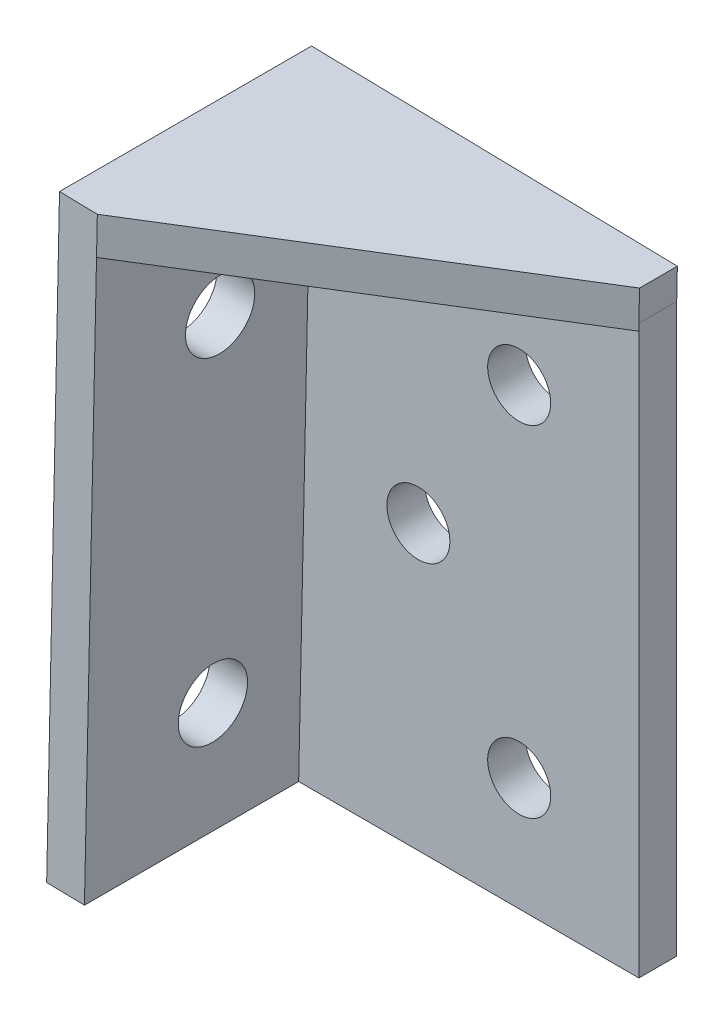
ISO-10303-21;
HEADER;
FILE_DESCRIPTION(('STEP AP214'),'2;1');
FILE_NAME('part.step','',(''),(''),'','','');
FILE_SCHEMA(('AUTOMOTIVE_DESIGN { 1 0 10303 214 1 1 1 1 }'));
ENDSEC;
DATA;
#1=APPLICATION_CONTEXT('core data for automotive mechanical design processes');
#2=APPLICATION_PROTOCOL_DEFINITION('international standard','automotive_design',2000,#1);
#3=PRODUCT_CONTEXT('',#1,'mechanical');
#4=PRODUCT('Part','Part','',(#3));
#5=PRODUCT_RELATED_PRODUCT_CATEGORY('part','',(#4));
#6=PRODUCT_DEFINITION_FORMATION('','',#4);
#7=PRODUCT_DEFINITION_CONTEXT('part definition',#1,'design');
#8=PRODUCT_DEFINITION('design','',#6,#7);
#9=PRODUCT_DEFINITION_SHAPE('','',#8);
#10=(LENGTH_UNIT() NAMED_UNIT(*) SI_UNIT(.MILLI.,.METRE.));
#11=(NAMED_UNIT(*) PLANE_ANGLE_UNIT() SI_UNIT($,.RADIAN.));
#12=(NAMED_UNIT(*) SI_UNIT($,.STERADIAN.) SOLID_ANGLE_UNIT());
#13=UNCERTAINTY_MEASURE_WITH_UNIT(LENGTH_MEASURE(1.E-05),#10,'distance_accuracy_value','');
#14=(GEOMETRIC_REPRESENTATION_CONTEXT(3) GLOBAL_UNCERTAINTY_ASSIGNED_CONTEXT((#13)) GLOBAL_UNIT_ASSIGNED_CONTEXT((#10,
#11,#12)) REPRESENTATION_CONTEXT('',''));
#15=CARTESIAN_POINT('',(0.,0.,0.));
#16=DIRECTION('',(0.,0.,1.));
#17=DIRECTION('',(1.,0.,0.));
#18=AXIS2_PLACEMENT_3D('',#15,#16,#17);
#19=CARTESIAN_POINT('',(0.,0.,3.));
#20=DIRECTION('',(0.,0.,1.));
#21=DIRECTION('',(1.,0.,0.));
#22=AXIS2_PLACEMENT_3D('',#19,#20,#21);
#23=PLANE('',#22);
#24=CARTESIAN_POINT('',(17.5,9.,3.));
#25=DIRECTION('',(0.,0.,1.));
#26=DIRECTION('',(1.,0.,0.));
#27=AXIS2_PLACEMENT_3D('',#24,#25,#26);
#28=CIRCLE('',#27,2.5);
#29=CARTESIAN_POINT('',(20.,9.,3.));
#30=VERTEX_POINT('',#29);
#31=EDGE_CURVE('E201',#30,#30,#28,.T.);
#32=ORIENTED_EDGE('',*,*,#31,.F.);
#33=EDGE_LOOP('',(#32));
#34=FACE_BOUND('',#33,.T.);
#35=CARTESIAN_POINT('',(17.5,36.,3.));
#36=DIRECTION('',(0.,0.,1.));
#37=DIRECTION('',(1.,0.,0.));
#38=AXIS2_PLACEMENT_3D('',#35,#36,#37);
#39=CIRCLE('',#38,2.5);
#40=CARTESIAN_POINT('',(20.,36.,3.));
#41=VERTEX_POINT('',#40);
#42=EDGE_CURVE('E209',#41,#41,#39,.T.);
#43=ORIENTED_EDGE('',*,*,#42,.F.);
#44=EDGE_LOOP('',(#43));
#45=FACE_BOUND('',#44,.T.);
#46=CARTESIAN_POINT('',(9.49999999999999,22.5,3.));
#47=DIRECTION('',(0.,0.,1.));
#48=DIRECTION('',(1.,0.,0.));
#49=AXIS2_PLACEMENT_3D('',#46,#47,#48);
#50=CIRCLE('',#49,2.5);
#51=CARTESIAN_POINT('',(12.,22.5,3.));
#52=VERTEX_POINT('',#51);
#53=EDGE_CURVE('E193',#52,#52,#50,.T.);
#54=ORIENTED_EDGE('',*,*,#53,.F.);
#55=EDGE_LOOP('',(#54));
#56=FACE_BOUND('',#55,.T.);
#57=DIRECTION('',(0.,1.,0.));
#58=VECTOR('',#57,1.);
#59=CARTESIAN_POINT('',(27.,45.,3.));
#60=LINE('',#59,#58);
#61=CARTESIAN_POINT('',(27.,0.,3.));
#62=VERTEX_POINT('',#61);
#63=CARTESIAN_POINT('',(27.,45.,3.));
#64=VERTEX_POINT('',#63);
#65=EDGE_CURVE('E221',#62,#64,#60,.T.);
#66=ORIENTED_EDGE('',*,*,#65,.T.);
#67=DIRECTION('',(-0.0212914078948775,-0.999773312281266,0.));
#68=VECTOR('',#67,1.);
#69=CARTESIAN_POINT('',(27.0520689086383,47.4449818214572,3.));
#70=LINE('',#69,#68);
#71=CARTESIAN_POINT('',(26.9881946849537,44.4456618846134,3.));
#72=VERTEX_POINT('',#71);
#73=EDGE_CURVE('E149',#64,#72,#70,.T.);
#74=ORIENTED_EDGE('',*,*,#73,.T.);
#75=DIRECTION('',(-0.999773312281266,0.0212914078948773,0.));
#76=VECTOR('',#75,1.);
#77=CARTESIAN_POINT('',(0.958330597046315,45.,3.));
#78=LINE('',#77,#76);
#79=CARTESIAN_POINT('',(0.958330597046324,45.,3.));
#80=VERTEX_POINT('',#79);
#81=EDGE_CURVE('E140',#72,#80,#78,.T.);
#82=ORIENTED_EDGE('',*,*,#81,.T.);
#83=DIRECTION('',(-0.0212914078948775,-0.999773312281266,0.));
#84=VECTOR('',#83,1.);
#85=CARTESIAN_POINT('',(0.,0.,3.));
#86=LINE('',#85,#84);
#87=CARTESIAN_POINT('',(0.,0.,3.));
#88=VERTEX_POINT('',#87);
#89=EDGE_CURVE('E226',#80,#88,#86,.T.);
#90=ORIENTED_EDGE('',*,*,#89,.T.);
#91=DIRECTION('',(1.,0.,0.));
#92=VECTOR('',#91,1.);
#93=CARTESIAN_POINT('',(27.,0.,3.));
#94=LINE('',#93,#92);
#95=EDGE_CURVE('E217',#88,#62,#94,.T.);
#96=ORIENTED_EDGE('',*,*,#95,.T.);
#97=EDGE_LOOP('',(#66,#74,#82,#90,#96));
#98=FACE_BOUND('',#97,.T.);
#99=ADVANCED_FACE('F44',(#34,#45,#56,#98),#23,.T.);
#100=CARTESIAN_POINT('',(0.,0.,0.));
#101=DIRECTION('',(0.,0.,1.));
#102=DIRECTION('',(1.,0.,0.));
#103=AXIS2_PLACEMENT_3D('',#100,#101,#102);
#104=PLANE('',#103);
#105=DIRECTION('',(-0.0212914078948775,-0.999773312281266,0.));
#106=VECTOR('',#105,1.);
#107=CARTESIAN_POINT('',(27.0520689086383,47.4449818214572,0.));
#108=LINE('',#107,#106);
#109=CARTESIAN_POINT('',(27.0520689086383,47.4449818214572,0.));
#110=VERTEX_POINT('',#109);
#111=CARTESIAN_POINT('',(27.,45.,0.));
#112=VERTEX_POINT('',#111);
#113=EDGE_CURVE('E245',#110,#112,#108,.T.);
#114=ORIENTED_EDGE('',*,*,#113,.T.);
#115=DIRECTION('',(0.,1.,0.));
#116=VECTOR('',#115,1.);
#117=CARTESIAN_POINT('',(27.,45.,0.));
#118=LINE('',#117,#116);
#119=CARTESIAN_POINT('',(27.,0.,0.));
#120=VERTEX_POINT('',#119);
#121=EDGE_CURVE('E222',#120,#112,#118,.T.);
#122=ORIENTED_EDGE('',*,*,#121,.F.);
#123=DIRECTION('',(1.,0.,0.));
#124=VECTOR('',#123,1.);
#125=CARTESIAN_POINT('',(27.,0.,0.));
#126=LINE('',#125,#124);
#127=CARTESIAN_POINT('',(0.,0.,0.));
#128=VERTEX_POINT('',#127);
#129=EDGE_CURVE('E213',#128,#120,#126,.T.);
#130=ORIENTED_EDGE('',*,*,#129,.F.);
#131=DIRECTION('',(0.999773312281266,-0.0212914078948775,0.));
#132=VECTOR('',#131,1.);
#133=CARTESIAN_POINT('',(-2.9993199368438,0.0638742236846324,0.));
#134=LINE('',#133,#132);
#135=CARTESIAN_POINT('',(-2.9993199368438,0.0638742236846324,0.));
#136=VERTEX_POINT('',#135);
#137=EDGE_CURVE('E189',#136,#128,#134,.T.);
#138=ORIENTED_EDGE('',*,*,#137,.F.);
#139=DIRECTION('',(-0.0212914078948775,-0.999773312281266,0.));
#140=VECTOR('',#139,1.);
#141=CARTESIAN_POINT('',(-2.9993199368438,0.0638742236846324,0.));
#142=LINE('',#141,#140);
#143=CARTESIAN_POINT('',(-1.97711511611284,48.0631941605284,0.));
#144=VERTEX_POINT('',#143);
#145=EDGE_CURVE('E169',#144,#136,#142,.T.);
#146=ORIENTED_EDGE('',*,*,#145,.F.);
#147=DIRECTION('',(-0.999773312281266,0.0212914078948773,0.));
#148=VECTOR('',#147,1.);
#149=CARTESIAN_POINT('',(27.0520689086383,47.4449818214572,0.));
#150=LINE('',#149,#148);
#151=EDGE_CURVE('E253',#110,#144,#150,.T.);
#152=ORIENTED_EDGE('',*,*,#151,.F.);
#153=EDGE_LOOP('',(#114,#122,#130,#138,#146,#152));
#154=FACE_BOUND('',#153,.T.);
#155=CARTESIAN_POINT('',(9.49999999999999,22.5,0.));
#156=DIRECTION('',(0.,0.,1.));
#157=DIRECTION('',(1.,0.,0.));
#158=AXIS2_PLACEMENT_3D('',#155,#156,#157);
#159=CIRCLE('',#158,2.5);
#160=CARTESIAN_POINT('',(12.,22.5,0.));
#161=VERTEX_POINT('',#160);
#162=EDGE_CURVE('E192',#161,#161,#159,.T.);
#163=ORIENTED_EDGE('',*,*,#162,.T.);
#164=EDGE_LOOP('',(#163));
#165=FACE_BOUND('',#164,.T.);
#166=CARTESIAN_POINT('',(17.5,9.,0.));
#167=DIRECTION('',(0.,0.,1.));
#168=DIRECTION('',(1.,0.,0.));
#169=AXIS2_PLACEMENT_3D('',#166,#167,#168);
#170=CIRCLE('',#169,2.5);
#171=CARTESIAN_POINT('',(20.,9.,0.));
#172=VERTEX_POINT('',#171);
#173=EDGE_CURVE('E197',#172,#172,#170,.T.);
#174=ORIENTED_EDGE('',*,*,#173,.T.);
#175=EDGE_LOOP('',(#174));
#176=FACE_BOUND('',#175,.T.);
#177=CARTESIAN_POINT('',(17.5,36.,0.));
#178=DIRECTION('',(0.,0.,1.));
#179=DIRECTION('',(1.,0.,0.));
#180=AXIS2_PLACEMENT_3D('',#177,#178,#179);
#181=CIRCLE('',#180,2.5);
#182=CARTESIAN_POINT('',(20.,36.,0.));
#183=VERTEX_POINT('',#182);
#184=EDGE_CURVE('E205',#183,#183,#181,.T.);
#185=ORIENTED_EDGE('',*,*,#184,.T.);
#186=EDGE_LOOP('',(#185));
#187=FACE_BOUND('',#186,.T.);
#188=ADVANCED_FACE('F250',(#154,#165,#176,#187),#104,.F.);
#189=CARTESIAN_POINT('',(27.,0.,3.));
#190=DIRECTION('',(0.,1.,0.));
#191=DIRECTION('',(0.,0.,1.));
#192=AXIS2_PLACEMENT_3D('',#189,#190,#191);
#193=PLANE('',#192);
#194=ORIENTED_EDGE('',*,*,#129,.T.);
#195=DIRECTION('',(0.,0.,-1.));
#196=VECTOR('',#195,1.);
#197=CARTESIAN_POINT('',(27.,0.,3.));
#198=LINE('',#197,#196);
#199=EDGE_CURVE('E11',#62,#120,#198,.T.);
#200=ORIENTED_EDGE('',*,*,#199,.F.);
#201=ORIENTED_EDGE('',*,*,#95,.F.);
#202=DIRECTION('',(0.,0.,-1.));
#203=VECTOR('',#202,1.);
#204=CARTESIAN_POINT('',(0.,0.,3.));
#205=LINE('',#204,#203);
#206=EDGE_CURVE('E61',#88,#128,#205,.T.);
#207=ORIENTED_EDGE('',*,*,#206,.T.);
#208=EDGE_LOOP('',(#194,#200,#201,#207));
#209=FACE_BOUND('',#208,.T.);
#210=ADVANCED_FACE('F46',(#209),#193,.F.);
#211=CARTESIAN_POINT('',(27.,45.,3.));
#212=DIRECTION('',(-1.,0.,0.));
#213=DIRECTION('',(0.,-1.,0.));
#214=AXIS2_PLACEMENT_3D('',#211,#212,#213);
#215=PLANE('',#214);
#216=ORIENTED_EDGE('',*,*,#121,.T.);
#217=DIRECTION('',(0.,0.,-1.));
#218=VECTOR('',#217,1.);
#219=CARTESIAN_POINT('',(27.,45.,3.));
#220=LINE('',#219,#218);
#221=EDGE_CURVE('E54',#64,#112,#220,.T.);
#222=ORIENTED_EDGE('',*,*,#221,.F.);
#223=ORIENTED_EDGE('',*,*,#65,.F.);
#224=ORIENTED_EDGE('',*,*,#199,.T.);
#225=EDGE_LOOP('',(#216,#222,#223,#224));
#226=FACE_BOUND('',#225,.T.);
#227=ADVANCED_FACE('F255',(#226),#215,.F.);
#228=CARTESIAN_POINT('',(17.5,36.,3.));
#229=DIRECTION('',(0.,0.,-1.));
#230=DIRECTION('',(-1.,0.,0.));
#231=AXIS2_PLACEMENT_3D('',#228,#229,#230);
#232=CYLINDRICAL_SURFACE('',#231,2.5);
#233=ORIENTED_EDGE('',*,*,#42,.T.);
#234=EDGE_LOOP('',(#233));
#235=FACE_BOUND('',#234,.T.);
#236=ORIENTED_EDGE('',*,*,#184,.F.);
#237=EDGE_LOOP('',(#236));
#238=FACE_BOUND('',#237,.T.);
#239=ADVANCED_FACE('F368',(#235,#238),#232,.F.);
#240=CARTESIAN_POINT('',(17.5,9.,3.));
#241=DIRECTION('',(0.,0.,-1.));
#242=DIRECTION('',(-1.,0.,0.));
#243=AXIS2_PLACEMENT_3D('',#240,#241,#242);
#244=CYLINDRICAL_SURFACE('',#243,2.5);
#245=ORIENTED_EDGE('',*,*,#31,.T.);
#246=EDGE_LOOP('',(#245));
#247=FACE_BOUND('',#246,.T.);
#248=ORIENTED_EDGE('',*,*,#173,.F.);
#249=EDGE_LOOP('',(#248));
#250=FACE_BOUND('',#249,.T.);
#251=ADVANCED_FACE('F375',(#247,#250),#244,.F.);
#252=CARTESIAN_POINT('',(9.49999999999999,22.5,3.));
#253=DIRECTION('',(0.,0.,-1.));
#254=DIRECTION('',(-1.,0.,0.));
#255=AXIS2_PLACEMENT_3D('',#252,#253,#254);
#256=CYLINDRICAL_SURFACE('',#255,2.5);
#257=ORIENTED_EDGE('',*,*,#53,.T.);
#258=EDGE_LOOP('',(#257));
#259=FACE_BOUND('',#258,.T.);
#260=ORIENTED_EDGE('',*,*,#162,.F.);
#261=EDGE_LOOP('',(#260));
#262=FACE_BOUND('',#261,.T.);
#263=ADVANCED_FACE('F406',(#259,#262),#256,.F.);
#264=CARTESIAN_POINT('',(0.,0.,0.));
#265=DIRECTION('',(0.999773312281266,-0.0212914078948775,0.));
#266=DIRECTION('',(0.0212914078948775,0.999773312281266,0.));
#267=AXIS2_PLACEMENT_3D('',#264,#265,#266);
#268=PLANE('',#267);
#269=CARTESIAN_POINT('',(0.191622671053897,8.99795981053139,10.));
#270=DIRECTION('',(-0.999773312281266,0.0212914078948775,0.));
#271=DIRECTION('',(-0.0212914078948775,-0.999773312281266,0.));
#272=AXIS2_PLACEMENT_3D('',#269,#270,#271);
#273=CIRCLE('',#272,2.74999999999999);
#274=CARTESIAN_POINT('',(0.133071299342984,6.24858320175792,10.));
#275=VERTEX_POINT('',#274);
#276=EDGE_CURVE('E147',#275,#275,#273,.T.);
#277=ORIENTED_EDGE('',*,*,#276,.T.);
#278=EDGE_LOOP('',(#277));
#279=FACE_BOUND('',#278,.T.);
#280=CARTESIAN_POINT('',(0.766707925992426,36.0020401894686,9.99999999999999));
#281=DIRECTION('',(-0.999773312281266,0.0212914078948775,0.));
#282=DIRECTION('',(-0.0212914078948775,-0.999773312281266,0.));
#283=AXIS2_PLACEMENT_3D('',#280,#281,#282);
#284=CIRCLE('',#283,2.75);
#285=CARTESIAN_POINT('',(0.708156554281513,33.2526635806951,9.99999999999999));
#286=VERTEX_POINT('',#285);
#287=EDGE_CURVE('E157',#286,#286,#284,.T.);
#288=ORIENTED_EDGE('',*,*,#287,.T.);
#289=EDGE_LOOP('',(#288));
#290=FACE_BOUND('',#289,.T.);
#291=ORIENTED_EDGE('',*,*,#89,.F.);
#292=DIRECTION('',(0.,0.,-1.));
#293=VECTOR('',#292,1.);
#294=CARTESIAN_POINT('',(0.958330597046323,45.,0.));
#295=LINE('',#294,#293);
#296=CARTESIAN_POINT('',(0.958330597046323,45.,20.));
#297=VERTEX_POINT('',#296);
#298=EDGE_CURVE('E174',#297,#80,#295,.T.);
#299=ORIENTED_EDGE('',*,*,#298,.F.);
#300=DIRECTION('',(0.0212914078948775,0.999773312281266,0.));
#301=VECTOR('',#300,1.);
#302=CARTESIAN_POINT('',(0.958330597046323,45.,20.));
#303=LINE('',#302,#301);
#304=CARTESIAN_POINT('',(0.,0.,20.));
#305=VERTEX_POINT('',#304);
#306=EDGE_CURVE('E137',#305,#297,#303,.T.);
#307=ORIENTED_EDGE('',*,*,#306,.F.);
#308=DIRECTION('',(0.,0.,1.));
#309=VECTOR('',#308,1.);
#310=CARTESIAN_POINT('',(0.,0.,20.));
#311=LINE('',#310,#309);
#312=EDGE_CURVE('E165',#88,#305,#311,.T.);
#313=ORIENTED_EDGE('',*,*,#312,.F.);
#314=EDGE_LOOP('',(#291,#299,#307,#313));
#315=FACE_BOUND('',#314,.T.);
#316=ADVANCED_FACE('F349',(#279,#290,#315),#268,.T.);
#317=CARTESIAN_POINT('',(-2.9993199368438,0.0638742236846324,0.));
#318=DIRECTION('',(0.999773312281266,-0.0212914078948775,0.));
#319=DIRECTION('',(0.0212914078948775,0.999773312281266,0.));
#320=AXIS2_PLACEMENT_3D('',#317,#318,#319);
#321=PLANE('',#320);
#322=ORIENTED_EDGE('',*,*,#145,.T.);
#323=DIRECTION('',(0.,0.,1.));
#324=VECTOR('',#323,1.);
#325=CARTESIAN_POINT('',(-2.9993199368438,0.063874223684632,20.));
#326=LINE('',#325,#324);
#327=CARTESIAN_POINT('',(-2.9993199368438,0.063874223684632,20.));
#328=VERTEX_POINT('',#327);
#329=EDGE_CURVE('E173',#136,#328,#326,.T.);
#330=ORIENTED_EDGE('',*,*,#329,.T.);
#331=DIRECTION('',(0.0212914078948775,0.999773312281266,0.));
#332=VECTOR('',#331,1.);
#333=CARTESIAN_POINT('',(-2.04098933979747,45.0638742236846,20.));
#334=LINE('',#333,#332);
#335=CARTESIAN_POINT('',(-1.97711511611284,48.0631941605284,20.));
#336=VERTEX_POINT('',#335);
#337=EDGE_CURVE('E177',#328,#336,#334,.T.);
#338=ORIENTED_EDGE('',*,*,#337,.T.);
#339=DIRECTION('',(0.,0.,1.));
#340=VECTOR('',#339,1.);
#341=CARTESIAN_POINT('',(-1.97711511611284,48.0631941605284,0.));
#342=LINE('',#341,#340);
#343=EDGE_CURVE('E128',#144,#336,#342,.T.);
#344=ORIENTED_EDGE('',*,*,#343,.F.);
#345=EDGE_LOOP('',(#322,#330,#338,#344));
#346=FACE_BOUND('',#345,.T.);
#347=CARTESIAN_POINT('',(-2.23261201085137,36.0659144131532,9.99999999999999));
#348=DIRECTION('',(-0.999773312281266,0.0212914078948775,0.));
#349=DIRECTION('',(-0.0212914078948775,-0.999773312281266,0.));
#350=AXIS2_PLACEMENT_3D('',#347,#348,#349);
#351=CIRCLE('',#350,2.75);
#352=CARTESIAN_POINT('',(-2.29116338256229,33.3165378043797,9.99999999999999));
#353=VERTEX_POINT('',#352);
#354=EDGE_CURVE('E161',#353,#353,#351,.T.);
#355=ORIENTED_EDGE('',*,*,#354,.F.);
#356=EDGE_LOOP('',(#355));
#357=FACE_BOUND('',#356,.T.);
#358=CARTESIAN_POINT('',(-2.8076972657899,9.06183403421602,10.));
#359=DIRECTION('',(-0.999773312281266,0.0212914078948775,0.));
#360=DIRECTION('',(-0.0212914078948775,-0.999773312281266,0.));
#361=AXIS2_PLACEMENT_3D('',#358,#359,#360);
#362=CIRCLE('',#361,2.74999999999999);
#363=CARTESIAN_POINT('',(-2.86624863750081,6.31245742544255,10.));
#364=VERTEX_POINT('',#363);
#365=EDGE_CURVE('E153',#364,#364,#362,.T.);
#366=ORIENTED_EDGE('',*,*,#365,.F.);
#367=EDGE_LOOP('',(#366));
#368=FACE_BOUND('',#367,.T.);
#369=ADVANCED_FACE('F263',(#346,#357,#368),#321,.F.);
#370=CARTESIAN_POINT('',(-2.9993199368438,0.063874223684632,20.));
#371=DIRECTION('',(0.0212914078948775,0.999773312281266,0.));
#372=DIRECTION('',(-0.999773312281266,0.0212914078948775,0.));
#373=AXIS2_PLACEMENT_3D('',#370,#371,#372);
#374=PLANE('',#373);
#375=ORIENTED_EDGE('',*,*,#206,.F.);
#376=ORIENTED_EDGE('',*,*,#312,.T.);
#377=DIRECTION('',(0.999773312281266,-0.0212914078948775,0.));
#378=VECTOR('',#377,1.);
#379=CARTESIAN_POINT('',(-2.9993199368438,0.063874223684632,20.));
#380=LINE('',#379,#378);
#381=EDGE_CURVE('E180',#328,#305,#380,.T.);
#382=ORIENTED_EDGE('',*,*,#381,.F.);
#383=ORIENTED_EDGE('',*,*,#329,.F.);
#384=ORIENTED_EDGE('',*,*,#137,.T.);
#385=EDGE_LOOP('',(#375,#376,#382,#383,#384));
#386=FACE_BOUND('',#385,.T.);
#387=ADVANCED_FACE('F260',(#386),#374,.F.);
#388=CARTESIAN_POINT('',(-2.04098933979747,45.0638742236846,20.));
#389=DIRECTION('',(0.,0.,-1.));
#390=DIRECTION('',(0.,1.,0.));
#391=AXIS2_PLACEMENT_3D('',#388,#389,#390);
#392=PLANE('',#391);
#393=ORIENTED_EDGE('',*,*,#306,.T.);
#394=DIRECTION('',(-0.0212914078948775,-0.999773312281266,0.));
#395=VECTOR('',#394,1.);
#396=CARTESIAN_POINT('',(1.02220482073096,47.9993199368438,20.));
#397=LINE('',#396,#395);
#398=CARTESIAN_POINT('',(1.02220482073096,47.9993199368438,20.));
#399=VERTEX_POINT('',#398);
#400=EDGE_CURVE('E113',#399,#297,#397,.T.);
#401=ORIENTED_EDGE('',*,*,#400,.F.);
#402=DIRECTION('',(0.999773312281266,-0.0212914078948773,0.));
#403=VECTOR('',#402,1.);
#404=CARTESIAN_POINT('',(-1.97711511611284,48.0631941605284,20.));
#405=LINE('',#404,#403);
#406=EDGE_CURVE('E121',#336,#399,#405,.T.);
#407=ORIENTED_EDGE('',*,*,#406,.F.);
#408=ORIENTED_EDGE('',*,*,#337,.F.);
#409=ORIENTED_EDGE('',*,*,#381,.T.);
#410=EDGE_LOOP('',(#393,#401,#407,#408,#409));
#411=FACE_BOUND('',#410,.T.);
#412=ADVANCED_FACE('F134',(#411),#392,.F.);
#413=CARTESIAN_POINT('',(-2.23261201085137,36.0659144131532,9.99999999999999));
#414=DIRECTION('',(0.999773312281266,-0.0212914078948775,0.));
#415=DIRECTION('',(0.0212914078948775,0.999773312281266,0.));
#416=AXIS2_PLACEMENT_3D('',#413,#414,#415);
#417=CYLINDRICAL_SURFACE('',#416,2.75);
#418=ORIENTED_EDGE('',*,*,#354,.T.);
#419=EDGE_LOOP('',(#418));
#420=FACE_BOUND('',#419,.T.);
#421=ORIENTED_EDGE('',*,*,#287,.F.);
#422=EDGE_LOOP('',(#421));
#423=FACE_BOUND('',#422,.T.);
#424=ADVANCED_FACE('F427',(#420,#423),#417,.F.);
#425=CARTESIAN_POINT('',(-2.8076972657899,9.06183403421602,10.));
#426=DIRECTION('',(0.999773312281266,-0.0212914078948775,0.));
#427=DIRECTION('',(0.0212914078948775,0.999773312281266,0.));
#428=AXIS2_PLACEMENT_3D('',#425,#426,#427);
#429=CYLINDRICAL_SURFACE('',#428,2.74999999999999);
#430=ORIENTED_EDGE('',*,*,#365,.T.);
#431=EDGE_LOOP('',(#430));
#432=FACE_BOUND('',#431,.T.);
#433=ORIENTED_EDGE('',*,*,#276,.F.);
#434=EDGE_LOOP('',(#433));
#435=FACE_BOUND('',#434,.T.);
#436=ADVANCED_FACE('F438',(#432,#435),#429,.F.);
#437=CARTESIAN_POINT('',(27.0520689086383,47.4449818214572,3.));
#438=DIRECTION('',(-0.999773312281266,0.0212914078948775,0.));
#439=DIRECTION('',(-0.0212914078948775,-0.999773312281266,0.));
#440=AXIS2_PLACEMENT_3D('',#437,#438,#439);
#441=PLANE('',#440);
#442=CARTESIAN_POINT('',(27.0520689086383,47.4449818214572,3.));
#443=VERTEX_POINT('',#442);
#444=EDGE_CURVE('E116',#443,#64,#70,.T.);
#445=ORIENTED_EDGE('',*,*,#444,.T.);
#446=ORIENTED_EDGE('',*,*,#221,.T.);
#447=ORIENTED_EDGE('',*,*,#113,.F.);
#448=DIRECTION('',(0.,0.,-1.));
#449=VECTOR('',#448,1.);
#450=CARTESIAN_POINT('',(27.0520689086383,47.4449818214572,3.));
#451=LINE('',#450,#449);
#452=EDGE_CURVE('E120',#443,#110,#451,.T.);
#453=ORIENTED_EDGE('',*,*,#452,.F.);
#454=EDGE_LOOP('',(#445,#446,#447,#453));
#455=FACE_BOUND('',#454,.T.);
#456=ADVANCED_FACE('F244',(#455),#441,.F.);
#457=CARTESIAN_POINT('',(1.02220482073096,47.9993199368438,20.));
#458=DIRECTION('',(-0.546598472676786,0.0116404897925545,-0.837313924800486));
#459=DIRECTION('',(-0.837370659004363,0.,0.546635508761185));
#460=AXIS2_PLACEMENT_3D('',#457,#458,#459);
#461=PLANE('',#460);
#462=DIRECTION('',(0.837124116017009,-0.0178275923089878,-0.546722407932221));
#463=VECTOR('',#462,1.);
#464=CARTESIAN_POINT('',(0.958330597046323,45.,20.));
#465=LINE('',#464,#463);
#466=EDGE_CURVE('E132',#297,#72,#465,.T.);
#467=ORIENTED_EDGE('',*,*,#466,.T.);
#468=ORIENTED_EDGE('',*,*,#73,.F.);
#469=ORIENTED_EDGE('',*,*,#444,.F.);
#470=DIRECTION('',(0.837124116017009,-0.0178275923089878,-0.546722407932221));
#471=VECTOR('',#470,1.);
#472=CARTESIAN_POINT('',(1.02220482073096,47.9993199368438,20.));
#473=LINE('',#472,#471);
#474=EDGE_CURVE('E108',#399,#443,#473,.T.);
#475=ORIENTED_EDGE('',*,*,#474,.F.);
#476=ORIENTED_EDGE('',*,*,#400,.T.);
#477=EDGE_LOOP('',(#467,#468,#469,#475,#476));
#478=FACE_BOUND('',#477,.T.);
#479=ADVANCED_FACE('F111',(#478),#461,.F.);
#480=CARTESIAN_POINT('',(1.02220482073095,47.9993199368438,0.));
#481=DIRECTION('',(0.0212914078948773,0.999773312281266,0.));
#482=DIRECTION('',(-0.999773312281266,0.0212914078948773,0.));
#483=AXIS2_PLACEMENT_3D('',#480,#481,#482);
#484=PLANE('',#483);
#485=ORIENTED_EDGE('',*,*,#406,.T.);
#486=ORIENTED_EDGE('',*,*,#474,.T.);
#487=ORIENTED_EDGE('',*,*,#452,.T.);
#488=ORIENTED_EDGE('',*,*,#151,.T.);
#489=ORIENTED_EDGE('',*,*,#343,.T.);
#490=EDGE_LOOP('',(#485,#486,#487,#488,#489));
#491=FACE_BOUND('',#490,.T.);
#492=ADVANCED_FACE('F125',(#491),#484,.T.);
#493=CARTESIAN_POINT('',(0.958330597046315,45.,0.));
#494=DIRECTION('',(0.0212914078948773,0.999773312281266,0.));
#495=DIRECTION('',(-0.999773312281266,0.0212914078948773,0.));
#496=AXIS2_PLACEMENT_3D('',#493,#494,#495);
#497=PLANE('',#496);
#498=ORIENTED_EDGE('',*,*,#81,.F.);
#499=ORIENTED_EDGE('',*,*,#466,.F.);
#500=ORIENTED_EDGE('',*,*,#298,.T.);
#501=EDGE_LOOP('',(#498,#499,#500));
#502=FACE_BOUND('',#501,.T.);
#503=ADVANCED_FACE('F350',(#502),#497,.F.);
#504=CLOSED_SHELL('',(#99,#188,#210,#227,#239,#251,#263,#316,#369,#387,#412,#424,#436,#456,#479,
#492,#503));
#505=MANIFOLD_SOLID_BREP('B2',#504);
#506=ADVANCED_BREP_SHAPE_REPRESENTATION('',(#18,#505),#14);
#507=SHAPE_DEFINITION_REPRESENTATION(#9,#506);
ENDSEC;
END-ISO-10303-21;
